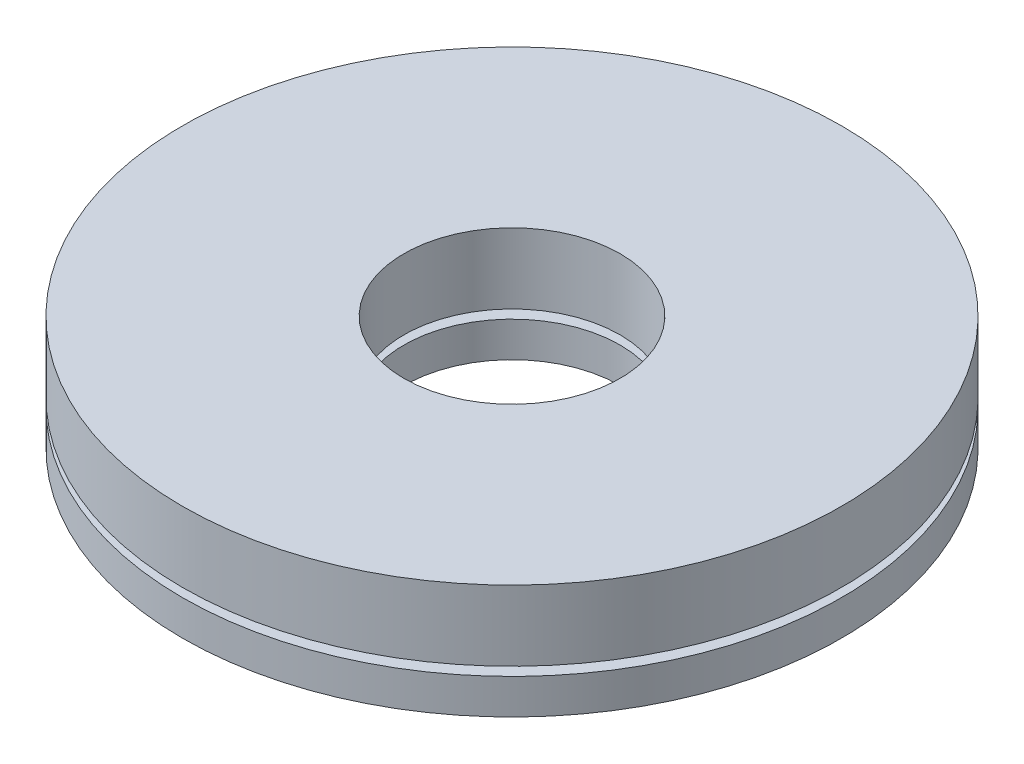
ISO-10303-21;
HEADER;
FILE_DESCRIPTION(('STEP AP214'),'2;1');
FILE_NAME('part.step','',(''),(''),'','','');
FILE_SCHEMA(('AUTOMOTIVE_DESIGN { 1 0 10303 214 1 1 1 1 }'));
ENDSEC;
DATA;
#1=APPLICATION_CONTEXT('core data for automotive mechanical design processes');
#2=APPLICATION_PROTOCOL_DEFINITION('international standard','automotive_design',2000,#1);
#3=PRODUCT_CONTEXT('',#1,'mechanical');
#4=PRODUCT('Part','Part','',(#3));
#5=PRODUCT_RELATED_PRODUCT_CATEGORY('part','',(#4));
#6=PRODUCT_DEFINITION_FORMATION('','',#4);
#7=PRODUCT_DEFINITION_CONTEXT('part definition',#1,'design');
#8=PRODUCT_DEFINITION('design','',#6,#7);
#9=PRODUCT_DEFINITION_SHAPE('','',#8);
#10=(LENGTH_UNIT() NAMED_UNIT(*) SI_UNIT(.MILLI.,.METRE.));
#11=(NAMED_UNIT(*) PLANE_ANGLE_UNIT() SI_UNIT($,.RADIAN.));
#12=(NAMED_UNIT(*) SI_UNIT($,.STERADIAN.) SOLID_ANGLE_UNIT());
#13=UNCERTAINTY_MEASURE_WITH_UNIT(LENGTH_MEASURE(1.E-05),#10,'distance_accuracy_value','');
#14=(GEOMETRIC_REPRESENTATION_CONTEXT(3) GLOBAL_UNCERTAINTY_ASSIGNED_CONTEXT((#13)) GLOBAL_UNIT_ASSIGNED_CONTEXT((#10,
#11,#12)) REPRESENTATION_CONTEXT('',''));
#15=CARTESIAN_POINT('',(0.,0.,0.));
#16=DIRECTION('',(0.,0.,1.));
#17=DIRECTION('',(1.,0.,0.));
#18=AXIS2_PLACEMENT_3D('',#15,#16,#17);
#19=CARTESIAN_POINT('',(0.,-2.25,0.));
#20=DIRECTION('',(0.,-1.,0.));
#21=DIRECTION('',(0.,0.,-1.));
#22=AXIS2_PLACEMENT_3D('',#19,#20,#21);
#23=PLANE('',#22);
#24=CARTESIAN_POINT('',(0.,-2.25,0.));
#25=DIRECTION('',(0.,-1.,0.));
#26=DIRECTION('',(0.,0.,-1.));
#27=AXIS2_PLACEMENT_3D('',#24,#25,#26);
#28=CIRCLE('',#27,9.375);
#29=CARTESIAN_POINT('',(0.,-2.25,-9.375));
#30=VERTEX_POINT('',#29);
#31=EDGE_CURVE('E11',#30,#30,#28,.T.);
#32=ORIENTED_EDGE('',*,*,#31,.T.);
#33=EDGE_LOOP('',(#32));
#34=FACE_BOUND('',#33,.T.);
#35=CARTESIAN_POINT('',(0.,-2.25,0.));
#36=DIRECTION('',(0.,-1.,0.));
#37=DIRECTION('',(0.,0.,-1.));
#38=AXIS2_PLACEMENT_3D('',#35,#36,#37);
#39=CIRCLE('',#38,3.075);
#40=CARTESIAN_POINT('',(0.,-2.25,-3.075));
#41=VERTEX_POINT('',#40);
#42=EDGE_CURVE('E58',#41,#41,#39,.T.);
#43=ORIENTED_EDGE('',*,*,#42,.F.);
#44=EDGE_LOOP('',(#43));
#45=FACE_BOUND('',#44,.T.);
#46=ADVANCED_FACE('F47',(#34,#45),#23,.T.);
#47=CARTESIAN_POINT('',(0.,-1.25,0.));
#48=DIRECTION('',(0.,-1.,0.));
#49=DIRECTION('',(0.,0.,-1.));
#50=AXIS2_PLACEMENT_3D('',#47,#48,#49);
#51=PLANE('',#50);
#52=CARTESIAN_POINT('',(0.,-1.25,0.));
#53=DIRECTION('',(0.,-1.,0.));
#54=DIRECTION('',(0.,0.,-1.));
#55=AXIS2_PLACEMENT_3D('',#52,#53,#54);
#56=CIRCLE('',#55,9.375);
#57=CARTESIAN_POINT('',(0.,-1.25,-9.375));
#58=VERTEX_POINT('',#57);
#59=EDGE_CURVE('E51',#58,#58,#56,.T.);
#60=ORIENTED_EDGE('',*,*,#59,.F.);
#61=EDGE_LOOP('',(#60));
#62=FACE_BOUND('',#61,.T.);
#63=CARTESIAN_POINT('',(0.,-1.25,0.));
#64=DIRECTION('',(0.,-1.,0.));
#65=DIRECTION('',(0.,0.,-1.));
#66=AXIS2_PLACEMENT_3D('',#63,#64,#65);
#67=CIRCLE('',#66,3.075);
#68=CARTESIAN_POINT('',(0.,-1.25,-3.075));
#69=VERTEX_POINT('',#68);
#70=EDGE_CURVE('E60',#69,#69,#67,.T.);
#71=ORIENTED_EDGE('',*,*,#70,.T.);
#72=EDGE_LOOP('',(#71));
#73=FACE_BOUND('',#72,.T.);
#74=ADVANCED_FACE('F70',(#62,#73),#51,.F.);
#75=CARTESIAN_POINT('',(0.,-2.25,0.));
#76=DIRECTION('',(0.,1.,0.));
#77=DIRECTION('',(0.,0.,1.));
#78=AXIS2_PLACEMENT_3D('',#75,#76,#77);
#79=CYLINDRICAL_SURFACE('',#78,9.375);
#80=ORIENTED_EDGE('',*,*,#31,.F.);
#81=EDGE_LOOP('',(#80));
#82=FACE_BOUND('',#81,.T.);
#83=ORIENTED_EDGE('',*,*,#59,.T.);
#84=EDGE_LOOP('',(#83));
#85=FACE_BOUND('',#84,.T.);
#86=ADVANCED_FACE('F49',(#82,#85),#79,.T.);
#87=CARTESIAN_POINT('',(0.,-2.25,0.));
#88=DIRECTION('',(0.,1.,0.));
#89=DIRECTION('',(0.,0.,1.));
#90=AXIS2_PLACEMENT_3D('',#87,#88,#89);
#91=CYLINDRICAL_SURFACE('',#90,3.075);
#92=ORIENTED_EDGE('',*,*,#42,.T.);
#93=EDGE_LOOP('',(#92));
#94=FACE_BOUND('',#93,.T.);
#95=ORIENTED_EDGE('',*,*,#70,.F.);
#96=EDGE_LOOP('',(#95));
#97=FACE_BOUND('',#96,.T.);
#98=ADVANCED_FACE('F66',(#94,#97),#91,.F.);
#99=CLOSED_SHELL('',(#46,#74,#86,#98));
#100=MANIFOLD_SOLID_BREP('B2',#99);
#101=CARTESIAN_POINT('',(0.,1.,0.));
#102=DIRECTION('',(0.,1.,0.));
#103=DIRECTION('',(0.,0.,1.));
#104=AXIS2_PLACEMENT_3D('',#101,#102,#103);
#105=PLANE('',#104);
#106=CARTESIAN_POINT('',(0.,1.,0.));
#107=DIRECTION('',(0.,1.,0.));
#108=DIRECTION('',(0.,0.,1.));
#109=AXIS2_PLACEMENT_3D('',#106,#107,#108);
#110=CIRCLE('',#109,9.375);
#111=CARTESIAN_POINT('',(0.,1.,9.375));
#112=VERTEX_POINT('',#111);
#113=EDGE_CURVE('E46',#112,#112,#110,.T.);
#114=ORIENTED_EDGE('',*,*,#113,.T.);
#115=EDGE_LOOP('',(#114));
#116=FACE_BOUND('',#115,.T.);
#117=CARTESIAN_POINT('',(0.,1.,0.));
#118=DIRECTION('',(0.,1.,0.));
#119=DIRECTION('',(0.,0.,1.));
#120=AXIS2_PLACEMENT_3D('',#117,#118,#119);
#121=CIRCLE('',#120,3.075);
#122=CARTESIAN_POINT('',(0.,1.,3.075));
#123=VERTEX_POINT('',#122);
#124=EDGE_CURVE('E119',#123,#123,#121,.T.);
#125=ORIENTED_EDGE('',*,*,#124,.F.);
#126=EDGE_LOOP('',(#125));
#127=FACE_BOUND('',#126,.T.);
#128=ADVANCED_FACE('F108',(#116,#127),#105,.T.);
#129=CARTESIAN_POINT('',(0.,-1.,0.));
#130=DIRECTION('',(0.,1.,0.));
#131=DIRECTION('',(0.,0.,1.));
#132=AXIS2_PLACEMENT_3D('',#129,#130,#131);
#133=PLANE('',#132);
#134=CARTESIAN_POINT('',(0.,-1.,0.));
#135=DIRECTION('',(0.,1.,0.));
#136=DIRECTION('',(0.,0.,1.));
#137=AXIS2_PLACEMENT_3D('',#134,#135,#136);
#138=CIRCLE('',#137,9.375);
#139=CARTESIAN_POINT('',(0.,-1.,9.375));
#140=VERTEX_POINT('',#139);
#141=EDGE_CURVE('E112',#140,#140,#138,.T.);
#142=ORIENTED_EDGE('',*,*,#141,.F.);
#143=EDGE_LOOP('',(#142));
#144=FACE_BOUND('',#143,.T.);
#145=CARTESIAN_POINT('',(0.,-1.,0.));
#146=DIRECTION('',(0.,1.,0.));
#147=DIRECTION('',(0.,0.,1.));
#148=AXIS2_PLACEMENT_3D('',#145,#146,#147);
#149=CIRCLE('',#148,3.075);
#150=CARTESIAN_POINT('',(0.,-1.,3.075));
#151=VERTEX_POINT('',#150);
#152=EDGE_CURVE('E121',#151,#151,#149,.T.);
#153=ORIENTED_EDGE('',*,*,#152,.T.);
#154=EDGE_LOOP('',(#153));
#155=FACE_BOUND('',#154,.T.);
#156=ADVANCED_FACE('F131',(#144,#155),#133,.F.);
#157=CARTESIAN_POINT('',(0.,1.,0.));
#158=DIRECTION('',(0.,-1.,0.));
#159=DIRECTION('',(0.,0.,-1.));
#160=AXIS2_PLACEMENT_3D('',#157,#158,#159);
#161=CYLINDRICAL_SURFACE('',#160,9.375);
#162=ORIENTED_EDGE('',*,*,#113,.F.);
#163=EDGE_LOOP('',(#162));
#164=FACE_BOUND('',#163,.T.);
#165=ORIENTED_EDGE('',*,*,#141,.T.);
#166=EDGE_LOOP('',(#165));
#167=FACE_BOUND('',#166,.T.);
#168=ADVANCED_FACE('F110',(#164,#167),#161,.T.);
#169=CARTESIAN_POINT('',(0.,1.,0.));
#170=DIRECTION('',(0.,-1.,0.));
#171=DIRECTION('',(0.,0.,-1.));
#172=AXIS2_PLACEMENT_3D('',#169,#170,#171);
#173=CYLINDRICAL_SURFACE('',#172,3.075);
#174=ORIENTED_EDGE('',*,*,#124,.T.);
#175=EDGE_LOOP('',(#174));
#176=FACE_BOUND('',#175,.T.);
#177=ORIENTED_EDGE('',*,*,#152,.F.);
#178=EDGE_LOOP('',(#177));
#179=FACE_BOUND('',#178,.T.);
#180=ADVANCED_FACE('F127',(#176,#179),#173,.F.);
#181=CLOSED_SHELL('',(#128,#156,#168,#180));
#182=MANIFOLD_SOLID_BREP('B6',#181);
#183=ADVANCED_BREP_SHAPE_REPRESENTATION('',(#18,#100,#182),#14);
#184=SHAPE_DEFINITION_REPRESENTATION(#9,#183);
ENDSEC;
END-ISO-10303-21;
